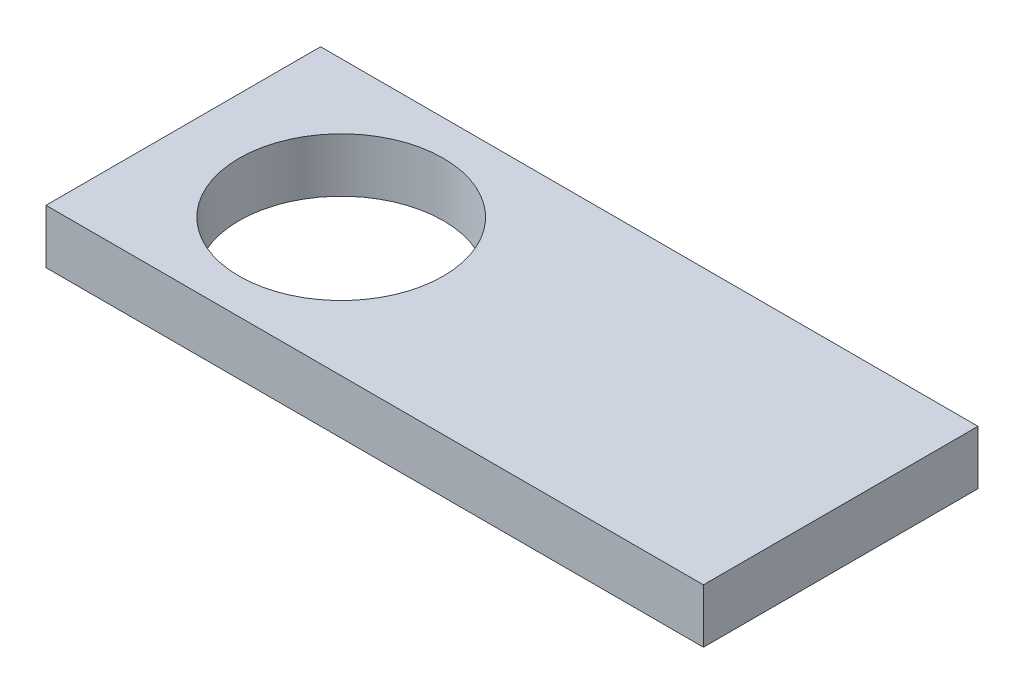
ISO-10303-21;
HEADER;
FILE_DESCRIPTION(('STEP AP214'),'2;1');
FILE_NAME('part.step','',(''),(''),'','','');
FILE_SCHEMA(('AUTOMOTIVE_DESIGN { 1 0 10303 214 1 1 1 1 }'));
ENDSEC;
DATA;
#1=APPLICATION_CONTEXT('core data for automotive mechanical design processes');
#2=APPLICATION_PROTOCOL_DEFINITION('international standard','automotive_design',2000,#1);
#3=PRODUCT_CONTEXT('',#1,'mechanical');
#4=PRODUCT('Part','Part','',(#3));
#5=PRODUCT_RELATED_PRODUCT_CATEGORY('part','',(#4));
#6=PRODUCT_DEFINITION_FORMATION('','',#4);
#7=PRODUCT_DEFINITION_CONTEXT('part definition',#1,'design');
#8=PRODUCT_DEFINITION('design','',#6,#7);
#9=PRODUCT_DEFINITION_SHAPE('','',#8);
#10=(LENGTH_UNIT() NAMED_UNIT(*) SI_UNIT(.MILLI.,.METRE.));
#11=(NAMED_UNIT(*) PLANE_ANGLE_UNIT() SI_UNIT($,.RADIAN.));
#12=(NAMED_UNIT(*) SI_UNIT($,.STERADIAN.) SOLID_ANGLE_UNIT());
#13=UNCERTAINTY_MEASURE_WITH_UNIT(LENGTH_MEASURE(1.E-05),#10,'distance_accuracy_value','');
#14=(GEOMETRIC_REPRESENTATION_CONTEXT(3) GLOBAL_UNCERTAINTY_ASSIGNED_CONTEXT((#13)) GLOBAL_UNIT_ASSIGNED_CONTEXT((#10,
#11,#12)) REPRESENTATION_CONTEXT('',''));
#15=CARTESIAN_POINT('',(0.,0.,0.));
#16=DIRECTION('',(0.,0.,1.));
#17=DIRECTION('',(1.,0.,0.));
#18=AXIS2_PLACEMENT_3D('',#15,#16,#17);
#19=CARTESIAN_POINT('',(0.,6.3,-32.));
#20=DIRECTION('',(1.,0.,0.));
#21=DIRECTION('',(0.,0.,-1.));
#22=AXIS2_PLACEMENT_3D('',#19,#20,#21);
#23=PLANE('',#22);
#24=DIRECTION('',(0.,0.,1.));
#25=VECTOR('',#24,1.);
#26=CARTESIAN_POINT('',(0.,0.,-32.));
#27=LINE('',#26,#25);
#28=CARTESIAN_POINT('',(0.,0.,-32.));
#29=VERTEX_POINT('',#28);
#30=CARTESIAN_POINT('',(0.,0.,0.));
#31=VERTEX_POINT('',#30);
#32=EDGE_CURVE('E107',#29,#31,#27,.T.);
#33=ORIENTED_EDGE('',*,*,#32,.T.);
#34=DIRECTION('',(0.,-1.,0.));
#35=VECTOR('',#34,1.);
#36=CARTESIAN_POINT('',(0.,6.3,0.));
#37=LINE('',#36,#35);
#38=CARTESIAN_POINT('',(0.,6.3,0.));
#39=VERTEX_POINT('',#38);
#40=EDGE_CURVE('E11',#39,#31,#37,.T.);
#41=ORIENTED_EDGE('',*,*,#40,.F.);
#42=DIRECTION('',(0.,0.,1.));
#43=VECTOR('',#42,1.);
#44=CARTESIAN_POINT('',(0.,6.3,-32.));
#45=LINE('',#44,#43);
#46=CARTESIAN_POINT('',(0.,6.3,-32.));
#47=VERTEX_POINT('',#46);
#48=EDGE_CURVE('E89',#47,#39,#45,.T.);
#49=ORIENTED_EDGE('',*,*,#48,.F.);
#50=DIRECTION('',(0.,-1.,0.));
#51=VECTOR('',#50,1.);
#52=CARTESIAN_POINT('',(0.,6.3,-32.));
#53=LINE('',#52,#51);
#54=EDGE_CURVE('E56',#47,#29,#53,.T.);
#55=ORIENTED_EDGE('',*,*,#54,.T.);
#56=EDGE_LOOP('',(#33,#41,#49,#55));
#57=FACE_BOUND('',#56,.T.);
#58=ADVANCED_FACE('F39',(#57),#23,.F.);
#59=CARTESIAN_POINT('',(0.,6.3,0.));
#60=DIRECTION('',(0.,0.,-1.));
#61=DIRECTION('',(-1.,0.,0.));
#62=AXIS2_PLACEMENT_3D('',#59,#60,#61);
#63=PLANE('',#62);
#64=DIRECTION('',(1.,0.,0.));
#65=VECTOR('',#64,1.);
#66=CARTESIAN_POINT('',(0.,0.,0.));
#67=LINE('',#66,#65);
#68=CARTESIAN_POINT('',(76.61,0.,0.));
#69=VERTEX_POINT('',#68);
#70=EDGE_CURVE('E95',#31,#69,#67,.T.);
#71=ORIENTED_EDGE('',*,*,#70,.T.);
#72=DIRECTION('',(0.,-1.,0.));
#73=VECTOR('',#72,1.);
#74=CARTESIAN_POINT('',(76.61,6.3,0.));
#75=LINE('',#74,#73);
#76=CARTESIAN_POINT('',(76.61,6.3,0.));
#77=VERTEX_POINT('',#76);
#78=EDGE_CURVE('E48',#77,#69,#75,.T.);
#79=ORIENTED_EDGE('',*,*,#78,.F.);
#80=DIRECTION('',(1.,0.,0.));
#81=VECTOR('',#80,1.);
#82=CARTESIAN_POINT('',(0.,6.3,0.));
#83=LINE('',#82,#81);
#84=EDGE_CURVE('E82',#39,#77,#83,.T.);
#85=ORIENTED_EDGE('',*,*,#84,.F.);
#86=ORIENTED_EDGE('',*,*,#40,.T.);
#87=EDGE_LOOP('',(#71,#79,#85,#86));
#88=FACE_BOUND('',#87,.T.);
#89=ADVANCED_FACE('F94',(#88),#63,.F.);
#90=CARTESIAN_POINT('',(76.61,6.3,0.));
#91=DIRECTION('',(-1.,0.,0.));
#92=DIRECTION('',(0.,0.,1.));
#93=AXIS2_PLACEMENT_3D('',#90,#91,#92);
#94=PLANE('',#93);
#95=DIRECTION('',(0.,0.,-1.));
#96=VECTOR('',#95,1.);
#97=CARTESIAN_POINT('',(76.61,0.,0.));
#98=LINE('',#97,#96);
#99=CARTESIAN_POINT('',(76.61,0.,-32.));
#100=VERTEX_POINT('',#99);
#101=EDGE_CURVE('E113',#69,#100,#98,.T.);
#102=ORIENTED_EDGE('',*,*,#101,.T.);
#103=DIRECTION('',(0.,-1.,0.));
#104=VECTOR('',#103,1.);
#105=CARTESIAN_POINT('',(76.61,6.3,-32.));
#106=LINE('',#105,#104);
#107=CARTESIAN_POINT('',(76.61,6.3,-32.));
#108=VERTEX_POINT('',#107);
#109=EDGE_CURVE('E71',#108,#100,#106,.T.);
#110=ORIENTED_EDGE('',*,*,#109,.F.);
#111=DIRECTION('',(0.,0.,-1.));
#112=VECTOR('',#111,1.);
#113=CARTESIAN_POINT('',(76.61,6.3,0.));
#114=LINE('',#113,#112);
#115=EDGE_CURVE('E88',#77,#108,#114,.T.);
#116=ORIENTED_EDGE('',*,*,#115,.F.);
#117=ORIENTED_EDGE('',*,*,#78,.T.);
#118=EDGE_LOOP('',(#102,#110,#116,#117));
#119=FACE_BOUND('',#118,.T.);
#120=ADVANCED_FACE('F99',(#119),#94,.F.);
#121=CARTESIAN_POINT('',(0.,6.3,-32.));
#122=DIRECTION('',(0.,0.,-1.));
#123=DIRECTION('',(-1.,0.,0.));
#124=AXIS2_PLACEMENT_3D('',#121,#122,#123);
#125=PLANE('',#124);
#126=DIRECTION('',(1.,0.,0.));
#127=VECTOR('',#126,1.);
#128=CARTESIAN_POINT('',(0.,0.,-32.));
#129=LINE('',#128,#127);
#130=EDGE_CURVE('E116',#29,#100,#129,.T.);
#131=ORIENTED_EDGE('',*,*,#130,.F.);
#132=ORIENTED_EDGE('',*,*,#54,.F.);
#133=DIRECTION('',(1.,0.,0.));
#134=VECTOR('',#133,1.);
#135=CARTESIAN_POINT('',(0.,6.3,-32.));
#136=LINE('',#135,#134);
#137=EDGE_CURVE('E101',#47,#108,#136,.T.);
#138=ORIENTED_EDGE('',*,*,#137,.T.);
#139=ORIENTED_EDGE('',*,*,#109,.T.);
#140=EDGE_LOOP('',(#131,#132,#138,#139));
#141=FACE_BOUND('',#140,.T.);
#142=ADVANCED_FACE('F143',(#141),#125,.T.);
#143=CARTESIAN_POINT('',(0.,6.3,0.));
#144=DIRECTION('',(0.,1.,0.));
#145=DIRECTION('',(0.,0.,1.));
#146=AXIS2_PLACEMENT_3D('',#143,#144,#145);
#147=PLANE('',#146);
#148=CARTESIAN_POINT('',(18.4,6.3,-16.));
#149=DIRECTION('',(0.,1.,0.));
#150=DIRECTION('',(0.,0.,1.));
#151=AXIS2_PLACEMENT_3D('',#148,#149,#150);
#152=CIRCLE('',#151,11.9);
#153=CARTESIAN_POINT('',(18.4,6.3,-4.1));
#154=VERTEX_POINT('',#153);
#155=EDGE_CURVE('E126',#154,#154,#152,.T.);
#156=ORIENTED_EDGE('',*,*,#155,.F.);
#157=EDGE_LOOP('',(#156));
#158=FACE_BOUND('',#157,.T.);
#159=ORIENTED_EDGE('',*,*,#48,.T.);
#160=ORIENTED_EDGE('',*,*,#84,.T.);
#161=ORIENTED_EDGE('',*,*,#115,.T.);
#162=ORIENTED_EDGE('',*,*,#137,.F.);
#163=EDGE_LOOP('',(#159,#160,#161,#162));
#164=FACE_BOUND('',#163,.T.);
#165=ADVANCED_FACE('F85',(#158,#164),#147,.T.);
#166=CARTESIAN_POINT('',(0.,0.,0.));
#167=DIRECTION('',(0.,1.,0.));
#168=DIRECTION('',(0.,0.,1.));
#169=AXIS2_PLACEMENT_3D('',#166,#167,#168);
#170=PLANE('',#169);
#171=CARTESIAN_POINT('',(18.4,0.,-16.));
#172=DIRECTION('',(0.,1.,0.));
#173=DIRECTION('',(0.,0.,1.));
#174=AXIS2_PLACEMENT_3D('',#171,#172,#173);
#175=CIRCLE('',#174,11.9);
#176=CARTESIAN_POINT('',(18.4,0.,-4.1));
#177=VERTEX_POINT('',#176);
#178=EDGE_CURVE('E110',#177,#177,#175,.T.);
#179=ORIENTED_EDGE('',*,*,#178,.T.);
#180=EDGE_LOOP('',(#179));
#181=FACE_BOUND('',#180,.T.);
#182=ORIENTED_EDGE('',*,*,#32,.F.);
#183=ORIENTED_EDGE('',*,*,#130,.T.);
#184=ORIENTED_EDGE('',*,*,#101,.F.);
#185=ORIENTED_EDGE('',*,*,#70,.F.);
#186=EDGE_LOOP('',(#182,#183,#184,#185));
#187=FACE_BOUND('',#186,.T.);
#188=ADVANCED_FACE('F134',(#181,#187),#170,.F.);
#189=CARTESIAN_POINT('',(18.4,0.,-16.));
#190=DIRECTION('',(0.,1.,0.));
#191=DIRECTION('',(0.,0.,1.));
#192=AXIS2_PLACEMENT_3D('',#189,#190,#191);
#193=CYLINDRICAL_SURFACE('',#192,11.9);
#194=ORIENTED_EDGE('',*,*,#178,.F.);
#195=EDGE_LOOP('',(#194));
#196=FACE_BOUND('',#195,.T.);
#197=ORIENTED_EDGE('',*,*,#155,.T.);
#198=EDGE_LOOP('',(#197));
#199=FACE_BOUND('',#198,.T.);
#200=ADVANCED_FACE('F136',(#196,#199),#193,.F.);
#201=CLOSED_SHELL('',(#58,#89,#120,#142,#165,#188,#200));
#202=MANIFOLD_SOLID_BREP('B2',#201);
#203=ADVANCED_BREP_SHAPE_REPRESENTATION('',(#18,#202),#14);
#204=SHAPE_DEFINITION_REPRESENTATION(#9,#203);
ENDSEC;
END-ISO-10303-21;
